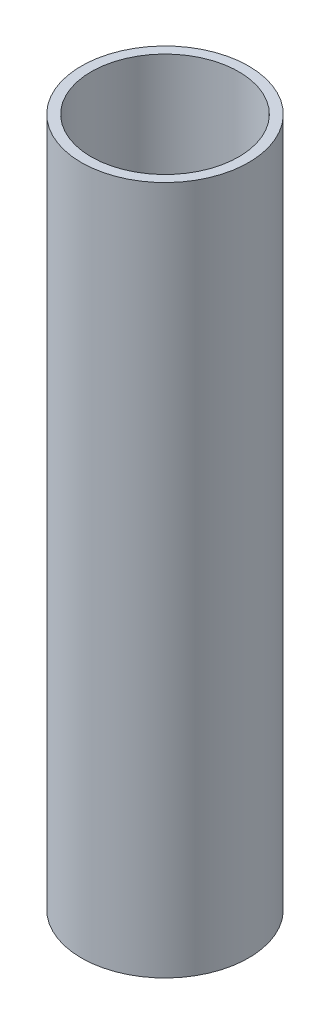
ISO-10303-21;
HEADER;
FILE_DESCRIPTION(('STEP AP214'),'2;1');
FILE_NAME('part.step','',(''),(''),'','','');
FILE_SCHEMA(('AUTOMOTIVE_DESIGN { 1 0 10303 214 1 1 1 1 }'));
ENDSEC;
DATA;
#1=APPLICATION_CONTEXT('core data for automotive mechanical design processes');
#2=APPLICATION_PROTOCOL_DEFINITION('international standard','automotive_design',2000,#1);
#3=PRODUCT_CONTEXT('',#1,'mechanical');
#4=PRODUCT('Part','Part','',(#3));
#5=PRODUCT_RELATED_PRODUCT_CATEGORY('part','',(#4));
#6=PRODUCT_DEFINITION_FORMATION('','',#4);
#7=PRODUCT_DEFINITION_CONTEXT('part definition',#1,'design');
#8=PRODUCT_DEFINITION('design','',#6,#7);
#9=PRODUCT_DEFINITION_SHAPE('','',#8);
#10=(LENGTH_UNIT() NAMED_UNIT(*) SI_UNIT(.MILLI.,.METRE.));
#11=(NAMED_UNIT(*) PLANE_ANGLE_UNIT() SI_UNIT($,.RADIAN.));
#12=(NAMED_UNIT(*) SI_UNIT($,.STERADIAN.) SOLID_ANGLE_UNIT());
#13=UNCERTAINTY_MEASURE_WITH_UNIT(LENGTH_MEASURE(1.E-05),#10,'distance_accuracy_value','');
#14=(GEOMETRIC_REPRESENTATION_CONTEXT(3) GLOBAL_UNCERTAINTY_ASSIGNED_CONTEXT((#13)) GLOBAL_UNIT_ASSIGNED_CONTEXT((#10,
#11,#12)) REPRESENTATION_CONTEXT('',''));
#15=CARTESIAN_POINT('',(0.,0.,0.));
#16=DIRECTION('',(0.,0.,1.));
#17=DIRECTION('',(1.,0.,0.));
#18=AXIS2_PLACEMENT_3D('',#15,#16,#17);
#19=CARTESIAN_POINT('',(0.,140.,0.));
#20=DIRECTION('',(0.,1.,0.));
#21=DIRECTION('',(0.,0.,1.));
#22=AXIS2_PLACEMENT_3D('',#19,#20,#21);
#23=PLANE('',#22);
#24=CARTESIAN_POINT('',(0.,140.,0.));
#25=DIRECTION('',(0.,1.,0.));
#26=DIRECTION('',(0.,0.,1.));
#27=AXIS2_PLACEMENT_3D('',#24,#25,#26);
#28=CIRCLE('',#27,17.);
#29=CARTESIAN_POINT('',(0.,140.,17.));
#30=VERTEX_POINT('',#29);
#31=EDGE_CURVE('E10',#30,#30,#28,.T.);
#32=ORIENTED_EDGE('',*,*,#31,.T.);
#33=EDGE_LOOP('',(#32));
#34=FACE_BOUND('',#33,.T.);
#35=CARTESIAN_POINT('',(0.,140.,0.));
#36=DIRECTION('',(0.,1.,0.));
#37=DIRECTION('',(0.,0.,1.));
#38=AXIS2_PLACEMENT_3D('',#35,#36,#37);
#39=CIRCLE('',#38,15.);
#40=CARTESIAN_POINT('',(0.,140.,15.));
#41=VERTEX_POINT('',#40);
#42=EDGE_CURVE('E42',#41,#41,#39,.T.);
#43=ORIENTED_EDGE('',*,*,#42,.F.);
#44=EDGE_LOOP('',(#43));
#45=FACE_BOUND('',#44,.T.);
#46=ADVANCED_FACE('F31',(#34,#45),#23,.T.);
#47=CARTESIAN_POINT('',(0.,0.,0.));
#48=DIRECTION('',(0.,1.,0.));
#49=DIRECTION('',(0.,0.,1.));
#50=AXIS2_PLACEMENT_3D('',#47,#48,#49);
#51=PLANE('',#50);
#52=CARTESIAN_POINT('',(0.,0.,0.));
#53=DIRECTION('',(0.,1.,0.));
#54=DIRECTION('',(0.,0.,1.));
#55=AXIS2_PLACEMENT_3D('',#52,#53,#54);
#56=CIRCLE('',#55,17.);
#57=CARTESIAN_POINT('',(0.,0.,17.));
#58=VERTEX_POINT('',#57);
#59=EDGE_CURVE('E35',#58,#58,#56,.T.);
#60=ORIENTED_EDGE('',*,*,#59,.F.);
#61=EDGE_LOOP('',(#60));
#62=FACE_BOUND('',#61,.T.);
#63=CARTESIAN_POINT('',(0.,0.,0.));
#64=DIRECTION('',(0.,1.,0.));
#65=DIRECTION('',(0.,0.,1.));
#66=AXIS2_PLACEMENT_3D('',#63,#64,#65);
#67=CIRCLE('',#66,15.);
#68=CARTESIAN_POINT('',(0.,0.,15.));
#69=VERTEX_POINT('',#68);
#70=EDGE_CURVE('E44',#69,#69,#67,.T.);
#71=ORIENTED_EDGE('',*,*,#70,.T.);
#72=EDGE_LOOP('',(#71));
#73=FACE_BOUND('',#72,.T.);
#74=ADVANCED_FACE('F54',(#62,#73),#51,.F.);
#75=CARTESIAN_POINT('',(0.,140.,0.));
#76=DIRECTION('',(0.,-1.,0.));
#77=DIRECTION('',(0.,0.,-1.));
#78=AXIS2_PLACEMENT_3D('',#75,#76,#77);
#79=CYLINDRICAL_SURFACE('',#78,17.);
#80=ORIENTED_EDGE('',*,*,#31,.F.);
#81=EDGE_LOOP('',(#80));
#82=FACE_BOUND('',#81,.T.);
#83=ORIENTED_EDGE('',*,*,#59,.T.);
#84=EDGE_LOOP('',(#83));
#85=FACE_BOUND('',#84,.T.);
#86=ADVANCED_FACE('F33',(#82,#85),#79,.T.);
#87=CARTESIAN_POINT('',(0.,140.,0.));
#88=DIRECTION('',(0.,-1.,0.));
#89=DIRECTION('',(0.,0.,-1.));
#90=AXIS2_PLACEMENT_3D('',#87,#88,#89);
#91=CYLINDRICAL_SURFACE('',#90,15.);
#92=ORIENTED_EDGE('',*,*,#42,.T.);
#93=EDGE_LOOP('',(#92));
#94=FACE_BOUND('',#93,.T.);
#95=ORIENTED_EDGE('',*,*,#70,.F.);
#96=EDGE_LOOP('',(#95));
#97=FACE_BOUND('',#96,.T.);
#98=ADVANCED_FACE('F50',(#94,#97),#91,.F.);
#99=CLOSED_SHELL('',(#46,#74,#86,#98));
#100=MANIFOLD_SOLID_BREP('B2',#99);
#101=ADVANCED_BREP_SHAPE_REPRESENTATION('',(#18,#100),#14);
#102=SHAPE_DEFINITION_REPRESENTATION(#9,#101);
ENDSEC;
END-ISO-10303-21;
